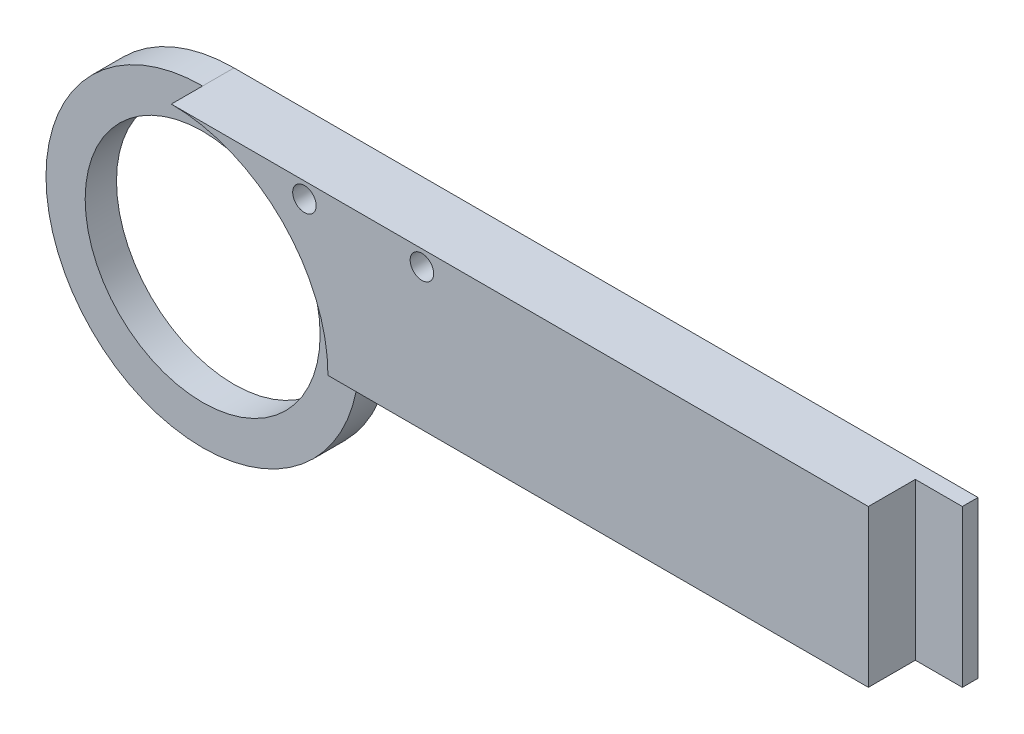
ISO-10303-21;
HEADER;
FILE_DESCRIPTION(('STEP AP214'),'2;1');
FILE_NAME('part.step','',(''),(''),'','','');
FILE_SCHEMA(('AUTOMOTIVE_DESIGN { 1 0 10303 214 1 1 1 1 }'));
ENDSEC;
DATA;
#1=APPLICATION_CONTEXT('core data for automotive mechanical design processes');
#2=APPLICATION_PROTOCOL_DEFINITION('international standard','automotive_design',2000,#1);
#3=PRODUCT_CONTEXT('',#1,'mechanical');
#4=PRODUCT('Part','Part','',(#3));
#5=PRODUCT_RELATED_PRODUCT_CATEGORY('part','',(#4));
#6=PRODUCT_DEFINITION_FORMATION('','',#4);
#7=PRODUCT_DEFINITION_CONTEXT('part definition',#1,'design');
#8=PRODUCT_DEFINITION('design','',#6,#7);
#9=PRODUCT_DEFINITION_SHAPE('','',#8);
#10=(LENGTH_UNIT() NAMED_UNIT(*) SI_UNIT(.MILLI.,.METRE.));
#11=(NAMED_UNIT(*) PLANE_ANGLE_UNIT() SI_UNIT($,.RADIAN.));
#12=(NAMED_UNIT(*) SI_UNIT($,.STERADIAN.) SOLID_ANGLE_UNIT());
#13=UNCERTAINTY_MEASURE_WITH_UNIT(LENGTH_MEASURE(1.E-05),#10,'distance_accuracy_value','');
#14=(GEOMETRIC_REPRESENTATION_CONTEXT(3) GLOBAL_UNCERTAINTY_ASSIGNED_CONTEXT((#13)) GLOBAL_UNIT_ASSIGNED_CONTEXT((#10,
#11,#12)) REPRESENTATION_CONTEXT('',''));
#15=CARTESIAN_POINT('',(0.,0.,0.));
#16=DIRECTION('',(0.,0.,1.));
#17=DIRECTION('',(1.,0.,0.));
#18=AXIS2_PLACEMENT_3D('',#15,#16,#17);
#19=CARTESIAN_POINT('',(51.7839068872006,23.7864077669903,0.));
#20=DIRECTION('',(1.,0.,0.));
#21=DIRECTION('',(0.,0.,-1.));
#22=AXIS2_PLACEMENT_3D('',#19,#20,#21);
#23=PLANE('',#22);
#24=DIRECTION('',(0.,0.,1.));
#25=VECTOR('',#24,1.);
#26=CARTESIAN_POINT('',(51.7839068872006,23.7864077669903,0.));
#27=LINE('',#26,#25);
#28=CARTESIAN_POINT('',(51.7839068872006,23.7864077669903,0.));
#29=VERTEX_POINT('',#28);
#30=CARTESIAN_POINT('',(51.7839068872006,23.7864077669903,2.));
#31=VERTEX_POINT('',#30);
#32=EDGE_CURVE('E141',#29,#31,#27,.T.);
#33=ORIENTED_EDGE('',*,*,#32,.T.);
#34=DIRECTION('',(0.,1.,0.));
#35=VECTOR('',#34,1.);
#36=CARTESIAN_POINT('',(51.7839068872006,23.7864077669903,2.));
#37=LINE('',#36,#35);
#38=CARTESIAN_POINT('',(51.7839068872006,3.7864077669903,2.));
#39=VERTEX_POINT('',#38);
#40=EDGE_CURVE('E129',#39,#31,#37,.T.);
#41=ORIENTED_EDGE('',*,*,#40,.F.);
#42=DIRECTION('',(0.,0.,1.));
#43=VECTOR('',#42,1.);
#44=CARTESIAN_POINT('',(51.7839068872006,3.7864077669903,0.));
#45=LINE('',#44,#43);
#46=CARTESIAN_POINT('',(51.7839068872006,3.7864077669903,0.));
#47=VERTEX_POINT('',#46);
#48=EDGE_CURVE('E128',#47,#39,#45,.T.);
#49=ORIENTED_EDGE('',*,*,#48,.F.);
#50=DIRECTION('',(0.,1.,0.));
#51=VECTOR('',#50,1.);
#52=CARTESIAN_POINT('',(51.7839068872006,23.7864077669903,0.));
#53=LINE('',#52,#51);
#54=EDGE_CURVE('E137',#47,#29,#53,.T.);
#55=ORIENTED_EDGE('',*,*,#54,.T.);
#56=EDGE_LOOP('',(#33,#41,#49,#55));
#57=FACE_BOUND('',#56,.T.);
#58=ADVANCED_FACE('F37',(#57),#23,.T.);
#59=CARTESIAN_POINT('',(-43.211335831246,3.7864077669903,8.));
#60=DIRECTION('',(0.,0.,-1.));
#61=DIRECTION('',(-1.,0.,0.));
#62=AXIS2_PLACEMENT_3D('',#59,#60,#61);
#63=CYLINDRICAL_SURFACE('',#62,20.);
#64=CARTESIAN_POINT('',(-43.211335831246,3.7864077669903,4.));
#65=DIRECTION('',(0.,0.,1.));
#66=DIRECTION('',(1.,0.,0.));
#67=AXIS2_PLACEMENT_3D('',#64,#65,#66);
#68=CIRCLE('',#67,20.);
#69=CARTESIAN_POINT('',(-43.211335831246,23.7864077669903,4.));
#70=VERTEX_POINT('',#69);
#71=CARTESIAN_POINT('',(-23.211335831246,3.7864077669903,4.));
#72=VERTEX_POINT('',#71);
#73=EDGE_CURVE('E152',#70,#72,#68,.T.);
#74=ORIENTED_EDGE('',*,*,#73,.F.);
#75=DIRECTION('',(0.,0.,-1.));
#76=VECTOR('',#75,1.);
#77=CARTESIAN_POINT('',(-43.211335831246,23.7864077669903,8.));
#78=LINE('',#77,#76);
#79=CARTESIAN_POINT('',(-43.211335831246,23.7864077669903,0.));
#80=VERTEX_POINT('',#79);
#81=EDGE_CURVE('E46',#70,#80,#78,.T.);
#82=ORIENTED_EDGE('',*,*,#81,.T.);
#83=CARTESIAN_POINT('',(-43.211335831246,3.7864077669903,0.));
#84=DIRECTION('',(0.,0.,1.));
#85=DIRECTION('',(1.,0.,0.));
#86=AXIS2_PLACEMENT_3D('',#83,#84,#85);
#87=CIRCLE('',#86,20.);
#88=CARTESIAN_POINT('',(-23.211335831246,3.7864077669903,0.));
#89=VERTEX_POINT('',#88);
#90=EDGE_CURVE('E163',#80,#89,#87,.T.);
#91=ORIENTED_EDGE('',*,*,#90,.T.);
#92=DIRECTION('',(0.,0.,-1.));
#93=VECTOR('',#92,1.);
#94=CARTESIAN_POINT('',(-23.211335831246,3.7864077669903,8.));
#95=LINE('',#94,#93);
#96=EDGE_CURVE('E157',#72,#89,#95,.T.);
#97=ORIENTED_EDGE('',*,*,#96,.F.);
#98=EDGE_LOOP('',(#74,#82,#91,#97));
#99=FACE_BOUND('',#98,.T.);
#100=ADVANCED_FACE('F195',(#99),#63,.T.);
#101=CARTESIAN_POINT('',(-43.211335831246,3.7864077669903,8.));
#102=DIRECTION('',(0.,0.,-1.));
#103=DIRECTION('',(-1.,0.,0.));
#104=AXIS2_PLACEMENT_3D('',#101,#102,#103);
#105=CYLINDRICAL_SURFACE('',#104,15.);
#106=CARTESIAN_POINT('',(-43.211335831246,3.7864077669903,0.));
#107=DIRECTION('',(0.,0.,1.));
#108=DIRECTION('',(1.,0.,0.));
#109=AXIS2_PLACEMENT_3D('',#106,#107,#108);
#110=CIRCLE('',#109,15.);
#111=CARTESIAN_POINT('',(-28.211335831246,3.7864077669903,0.));
#112=VERTEX_POINT('',#111);
#113=EDGE_CURVE('E151',#112,#112,#110,.T.);
#114=ORIENTED_EDGE('',*,*,#113,.F.);
#115=EDGE_LOOP('',(#114));
#116=FACE_BOUND('',#115,.T.);
#117=CARTESIAN_POINT('',(-43.211335831246,3.7864077669903,4.));
#118=DIRECTION('',(0.,0.,1.));
#119=DIRECTION('',(1.,0.,0.));
#120=AXIS2_PLACEMENT_3D('',#117,#118,#119);
#121=CIRCLE('',#120,15.);
#122=CARTESIAN_POINT('',(-28.211335831246,3.7864077669903,4.));
#123=VERTEX_POINT('',#122);
#124=EDGE_CURVE('E144',#123,#123,#121,.T.);
#125=ORIENTED_EDGE('',*,*,#124,.T.);
#126=EDGE_LOOP('',(#125));
#127=FACE_BOUND('',#126,.T.);
#128=ADVANCED_FACE('F39',(#116,#127),#105,.F.);
#129=CARTESIAN_POINT('',(0.,23.7864077669903,8.));
#130=DIRECTION('',(0.,-1.,0.));
#131=DIRECTION('',(0.,0.,-1.));
#132=AXIS2_PLACEMENT_3D('',#129,#130,#131);
#133=PLANE('',#132);
#134=DIRECTION('',(-1.,0.,0.));
#135=VECTOR('',#134,1.);
#136=CARTESIAN_POINT('',(0.,23.7864077669903,8.));
#137=LINE('',#136,#135);
#138=CARTESIAN_POINT('',(45.7839068872006,23.7864077669903,8.));
#139=VERTEX_POINT('',#138);
#140=CARTESIAN_POINT('',(-43.211335831246,23.7864077669903,8.));
#141=VERTEX_POINT('',#140);
#142=EDGE_CURVE('E83',#139,#141,#137,.T.);
#143=ORIENTED_EDGE('',*,*,#142,.F.);
#144=DIRECTION('',(0.,0.,1.));
#145=VECTOR('',#144,1.);
#146=CARTESIAN_POINT('',(45.7839068872006,23.7864077669903,2.));
#147=LINE('',#146,#145);
#148=CARTESIAN_POINT('',(45.7839068872006,23.7864077669903,2.));
#149=VERTEX_POINT('',#148);
#150=EDGE_CURVE('E118',#149,#139,#147,.T.);
#151=ORIENTED_EDGE('',*,*,#150,.F.);
#152=DIRECTION('',(-1.,0.,0.));
#153=VECTOR('',#152,1.);
#154=CARTESIAN_POINT('',(45.7839068872006,23.7864077669903,2.));
#155=LINE('',#154,#153);
#156=EDGE_CURVE('E119',#31,#149,#155,.T.);
#157=ORIENTED_EDGE('',*,*,#156,.F.);
#158=ORIENTED_EDGE('',*,*,#32,.F.);
#159=DIRECTION('',(-1.,0.,0.));
#160=VECTOR('',#159,1.);
#161=CARTESIAN_POINT('',(0.,23.7864077669903,0.));
#162=LINE('',#161,#160);
#163=EDGE_CURVE('E160',#29,#80,#162,.T.);
#164=ORIENTED_EDGE('',*,*,#163,.T.);
#165=ORIENTED_EDGE('',*,*,#81,.F.);
#166=EDGE_CURVE('E11',#141,#70,#78,.T.);
#167=ORIENTED_EDGE('',*,*,#166,.F.);
#168=EDGE_LOOP('',(#143,#151,#157,#158,#164,#165,#167));
#169=FACE_BOUND('',#168,.T.);
#170=ADVANCED_FACE('F190',(#169),#133,.F.);
#171=CARTESIAN_POINT('',(0.,3.7864077669903,8.));
#172=DIRECTION('',(0.,-1.,0.));
#173=DIRECTION('',(0.,0.,-1.));
#174=AXIS2_PLACEMENT_3D('',#171,#172,#173);
#175=PLANE('',#174);
#176=DIRECTION('',(0.,0.,1.));
#177=VECTOR('',#176,1.);
#178=CARTESIAN_POINT('',(45.7839068872006,3.7864077669903,2.));
#179=LINE('',#178,#177);
#180=CARTESIAN_POINT('',(45.7839068872006,3.7864077669903,2.));
#181=VERTEX_POINT('',#180);
#182=CARTESIAN_POINT('',(45.7839068872006,3.7864077669903,8.));
#183=VERTEX_POINT('',#182);
#184=EDGE_CURVE('E113',#181,#183,#179,.T.);
#185=ORIENTED_EDGE('',*,*,#184,.T.);
#186=DIRECTION('',(-1.,0.,0.));
#187=VECTOR('',#186,1.);
#188=CARTESIAN_POINT('',(0.,3.7864077669903,8.));
#189=LINE('',#188,#187);
#190=CARTESIAN_POINT('',(-23.211335831246,3.7864077669903,8.));
#191=VERTEX_POINT('',#190);
#192=EDGE_CURVE('E63',#183,#191,#189,.T.);
#193=ORIENTED_EDGE('',*,*,#192,.T.);
#194=EDGE_CURVE('E167',#191,#72,#95,.T.);
#195=ORIENTED_EDGE('',*,*,#194,.T.);
#196=ORIENTED_EDGE('',*,*,#96,.T.);
#197=DIRECTION('',(-1.,0.,0.));
#198=VECTOR('',#197,1.);
#199=CARTESIAN_POINT('',(0.,3.7864077669903,0.));
#200=LINE('',#199,#198);
#201=EDGE_CURVE('E155',#47,#89,#200,.T.);
#202=ORIENTED_EDGE('',*,*,#201,.F.);
#203=ORIENTED_EDGE('',*,*,#48,.T.);
#204=DIRECTION('',(1.,0.,0.));
#205=VECTOR('',#204,1.);
#206=CARTESIAN_POINT('',(45.7839068872006,3.7864077669903,2.));
#207=LINE('',#206,#205);
#208=EDGE_CURVE('E54',#181,#39,#207,.T.);
#209=ORIENTED_EDGE('',*,*,#208,.F.);
#210=EDGE_LOOP('',(#185,#193,#195,#196,#202,#203,#209));
#211=FACE_BOUND('',#210,.T.);
#212=ADVANCED_FACE('F126',(#211),#175,.T.);
#213=CARTESIAN_POINT('',(0.,0.,8.));
#214=DIRECTION('',(0.,0.,1.));
#215=DIRECTION('',(1.,0.,0.));
#216=AXIS2_PLACEMENT_3D('',#213,#214,#215);
#217=PLANE('',#216);
#218=CARTESIAN_POINT('',(-11.2160931127994,21.7864077669903,8.));
#219=DIRECTION('',(0.,0.,1.));
#220=DIRECTION('',(1.,0.,0.));
#221=AXIS2_PLACEMENT_3D('',#218,#219,#220);
#222=CIRCLE('',#221,1.5);
#223=CARTESIAN_POINT('',(-9.71609311279942,21.7864077669903,8.));
#224=VERTEX_POINT('',#223);
#225=EDGE_CURVE('E176',#224,#224,#222,.T.);
#226=ORIENTED_EDGE('',*,*,#225,.F.);
#227=EDGE_LOOP('',(#226));
#228=FACE_BOUND('',#227,.T.);
#229=CARTESIAN_POINT('',(-26.2160931127994,21.7864077669903,8.));
#230=DIRECTION('',(0.,0.,1.));
#231=DIRECTION('',(1.,0.,0.));
#232=AXIS2_PLACEMENT_3D('',#229,#230,#231);
#233=CIRCLE('',#232,1.5);
#234=CARTESIAN_POINT('',(-24.7160931127994,21.7864077669903,8.));
#235=VERTEX_POINT('',#234);
#236=EDGE_CURVE('E169',#235,#235,#233,.T.);
#237=ORIENTED_EDGE('',*,*,#236,.F.);
#238=EDGE_LOOP('',(#237));
#239=FACE_BOUND('',#238,.T.);
#240=DIRECTION('',(0.,-1.,0.));
#241=VECTOR('',#240,1.);
#242=CARTESIAN_POINT('',(45.7839068872006,23.7864077669903,8.));
#243=LINE('',#242,#241);
#244=EDGE_CURVE('E117',#139,#183,#243,.T.);
#245=ORIENTED_EDGE('',*,*,#244,.F.);
#246=ORIENTED_EDGE('',*,*,#142,.T.);
#247=CARTESIAN_POINT('',(-43.211335831246,3.7864077669903,8.));
#248=DIRECTION('',(0.,0.,1.));
#249=DIRECTION('',(1.,0.,0.));
#250=AXIS2_PLACEMENT_3D('',#247,#248,#249);
#251=CIRCLE('',#250,20.);
#252=EDGE_CURVE('E148',#191,#141,#251,.T.);
#253=ORIENTED_EDGE('',*,*,#252,.F.);
#254=ORIENTED_EDGE('',*,*,#192,.F.);
#255=EDGE_LOOP('',(#245,#246,#253,#254));
#256=FACE_BOUND('',#255,.T.);
#257=ADVANCED_FACE('F184',(#228,#239,#256),#217,.T.);
#258=CARTESIAN_POINT('',(0.,0.,0.));
#259=DIRECTION('',(0.,0.,1.));
#260=DIRECTION('',(1.,0.,0.));
#261=AXIS2_PLACEMENT_3D('',#258,#259,#260);
#262=PLANE('',#261);
#263=CARTESIAN_POINT('',(-11.2160931127994,21.7864077669903,0.));
#264=DIRECTION('',(0.,0.,1.));
#265=DIRECTION('',(1.,0.,0.));
#266=AXIS2_PLACEMENT_3D('',#263,#264,#265);
#267=CIRCLE('',#266,1.5);
#268=CARTESIAN_POINT('',(-9.71609311279942,21.7864077669903,0.));
#269=VERTEX_POINT('',#268);
#270=EDGE_CURVE('E41',#269,#269,#267,.T.);
#271=ORIENTED_EDGE('',*,*,#270,.T.);
#272=EDGE_LOOP('',(#271));
#273=FACE_BOUND('',#272,.T.);
#274=CARTESIAN_POINT('',(-26.2160931127994,21.7864077669903,0.));
#275=DIRECTION('',(0.,0.,1.));
#276=DIRECTION('',(1.,0.,0.));
#277=AXIS2_PLACEMENT_3D('',#274,#275,#276);
#278=CIRCLE('',#277,1.5);
#279=CARTESIAN_POINT('',(-24.7160931127994,21.7864077669903,0.));
#280=VERTEX_POINT('',#279);
#281=EDGE_CURVE('E136',#280,#280,#278,.T.);
#282=ORIENTED_EDGE('',*,*,#281,.T.);
#283=EDGE_LOOP('',(#282));
#284=FACE_BOUND('',#283,.T.);
#285=ORIENTED_EDGE('',*,*,#113,.T.);
#286=EDGE_LOOP('',(#285));
#287=FACE_BOUND('',#286,.T.);
#288=ORIENTED_EDGE('',*,*,#163,.F.);
#289=ORIENTED_EDGE('',*,*,#54,.F.);
#290=ORIENTED_EDGE('',*,*,#201,.T.);
#291=ORIENTED_EDGE('',*,*,#90,.F.);
#292=EDGE_LOOP('',(#288,#289,#290,#291));
#293=FACE_BOUND('',#292,.T.);
#294=ADVANCED_FACE('F187',(#273,#284,#287,#293),#262,.F.);
#295=CARTESIAN_POINT('',(-43.211335831246,3.7864077669903,4.));
#296=DIRECTION('',(0.,0.,1.));
#297=DIRECTION('',(1.,0.,0.));
#298=AXIS2_PLACEMENT_3D('',#295,#296,#297);
#299=CYLINDRICAL_SURFACE('',#298,20.);
#300=EDGE_CURVE('E149',#72,#70,#68,.T.);
#301=ORIENTED_EDGE('',*,*,#300,.F.);
#302=ORIENTED_EDGE('',*,*,#194,.F.);
#303=ORIENTED_EDGE('',*,*,#252,.T.);
#304=ORIENTED_EDGE('',*,*,#166,.T.);
#305=EDGE_LOOP('',(#301,#302,#303,#304));
#306=FACE_BOUND('',#305,.T.);
#307=ADVANCED_FACE('F196',(#306),#299,.F.);
#308=CARTESIAN_POINT('',(-43.211335831246,3.7864077669903,4.));
#309=DIRECTION('',(0.,0.,1.));
#310=DIRECTION('',(1.,0.,0.));
#311=AXIS2_PLACEMENT_3D('',#308,#309,#310);
#312=PLANE('',#311);
#313=ORIENTED_EDGE('',*,*,#124,.F.);
#314=EDGE_LOOP('',(#313));
#315=FACE_BOUND('',#314,.T.);
#316=ORIENTED_EDGE('',*,*,#300,.T.);
#317=ORIENTED_EDGE('',*,*,#73,.T.);
#318=EDGE_LOOP('',(#316,#317));
#319=FACE_BOUND('',#318,.T.);
#320=ADVANCED_FACE('F198',(#315,#319),#312,.T.);
#321=CARTESIAN_POINT('',(45.7839068872006,23.7864077669903,2.));
#322=DIRECTION('',(-1.,0.,0.));
#323=DIRECTION('',(0.,-1.,0.));
#324=AXIS2_PLACEMENT_3D('',#321,#322,#323);
#325=PLANE('',#324);
#326=ORIENTED_EDGE('',*,*,#244,.T.);
#327=ORIENTED_EDGE('',*,*,#184,.F.);
#328=DIRECTION('',(0.,-1.,0.));
#329=VECTOR('',#328,1.);
#330=CARTESIAN_POINT('',(45.7839068872006,23.7864077669903,2.));
#331=LINE('',#330,#329);
#332=EDGE_CURVE('E115',#149,#181,#331,.T.);
#333=ORIENTED_EDGE('',*,*,#332,.F.);
#334=ORIENTED_EDGE('',*,*,#150,.T.);
#335=EDGE_LOOP('',(#326,#327,#333,#334));
#336=FACE_BOUND('',#335,.T.);
#337=ADVANCED_FACE('F114',(#336),#325,.F.);
#338=CARTESIAN_POINT('',(0.,0.,2.));
#339=DIRECTION('',(0.,0.,1.));
#340=DIRECTION('',(1.,0.,0.));
#341=AXIS2_PLACEMENT_3D('',#338,#339,#340);
#342=PLANE('',#341);
#343=ORIENTED_EDGE('',*,*,#332,.T.);
#344=ORIENTED_EDGE('',*,*,#208,.T.);
#345=ORIENTED_EDGE('',*,*,#40,.T.);
#346=ORIENTED_EDGE('',*,*,#156,.T.);
#347=EDGE_LOOP('',(#343,#344,#345,#346));
#348=FACE_BOUND('',#347,.T.);
#349=ADVANCED_FACE('F121',(#348),#342,.T.);
#350=CARTESIAN_POINT('',(-26.2160931127994,21.7864077669903,-2.));
#351=DIRECTION('',(0.,0.,1.));
#352=DIRECTION('',(1.,0.,0.));
#353=AXIS2_PLACEMENT_3D('',#350,#351,#352);
#354=CYLINDRICAL_SURFACE('',#353,1.5);
#355=ORIENTED_EDGE('',*,*,#236,.T.);
#356=EDGE_LOOP('',(#355));
#357=FACE_BOUND('',#356,.T.);
#358=ORIENTED_EDGE('',*,*,#281,.F.);
#359=EDGE_LOOP('',(#358));
#360=FACE_BOUND('',#359,.T.);
#361=ADVANCED_FACE('F219',(#357,#360),#354,.F.);
#362=CARTESIAN_POINT('',(-11.2160931127994,21.7864077669903,-2.));
#363=DIRECTION('',(0.,0.,1.));
#364=DIRECTION('',(1.,0.,0.));
#365=AXIS2_PLACEMENT_3D('',#362,#363,#364);
#366=CYLINDRICAL_SURFACE('',#365,1.5);
#367=ORIENTED_EDGE('',*,*,#225,.T.);
#368=EDGE_LOOP('',(#367));
#369=FACE_BOUND('',#368,.T.);
#370=ORIENTED_EDGE('',*,*,#270,.F.);
#371=EDGE_LOOP('',(#370));
#372=FACE_BOUND('',#371,.T.);
#373=ADVANCED_FACE('F181',(#369,#372),#366,.F.);
#374=CLOSED_SHELL('',(#58,#100,#128,#170,#212,#257,#294,#307,#320,#337,#349,#361,#373));
#375=MANIFOLD_SOLID_BREP('B2',#374);
#376=ADVANCED_BREP_SHAPE_REPRESENTATION('',(#18,#375),#14);
#377=SHAPE_DEFINITION_REPRESENTATION(#9,#376);
ENDSEC;
END-ISO-10303-21;
